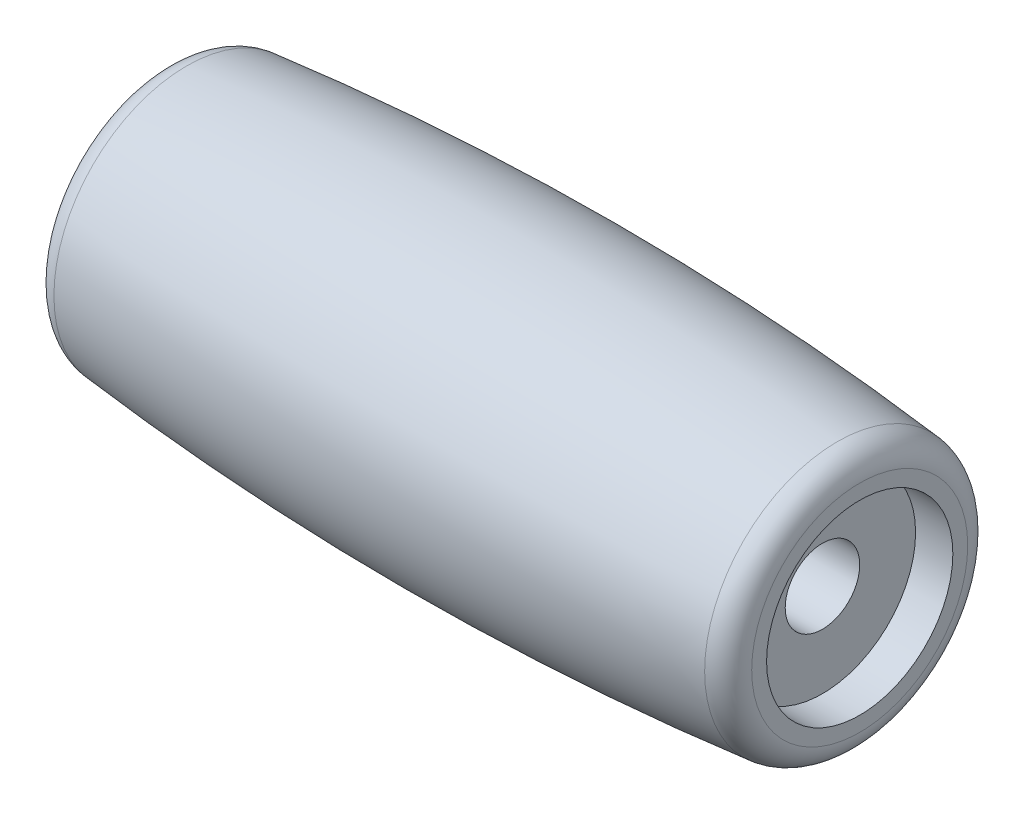
ISO-10303-21;
HEADER;
FILE_DESCRIPTION(('STEP AP214'),'2;1');
FILE_NAME('part.step','',(''),(''),'','','');
FILE_SCHEMA(('AUTOMOTIVE_DESIGN { 1 0 10303 214 1 1 1 1 }'));
ENDSEC;
DATA;
#1=APPLICATION_CONTEXT('core data for automotive mechanical design processes');
#2=APPLICATION_PROTOCOL_DEFINITION('international standard','automotive_design',2000,#1);
#3=PRODUCT_CONTEXT('',#1,'mechanical');
#4=PRODUCT('Part','Part','',(#3));
#5=PRODUCT_RELATED_PRODUCT_CATEGORY('part','',(#4));
#6=PRODUCT_DEFINITION_FORMATION('','',#4);
#7=PRODUCT_DEFINITION_CONTEXT('part definition',#1,'design');
#8=PRODUCT_DEFINITION('design','',#6,#7);
#9=PRODUCT_DEFINITION_SHAPE('','',#8);
#10=(LENGTH_UNIT() NAMED_UNIT(*) SI_UNIT(.MILLI.,.METRE.));
#11=(NAMED_UNIT(*) PLANE_ANGLE_UNIT() SI_UNIT($,.RADIAN.));
#12=(NAMED_UNIT(*) SI_UNIT($,.STERADIAN.) SOLID_ANGLE_UNIT());
#13=UNCERTAINTY_MEASURE_WITH_UNIT(LENGTH_MEASURE(1.E-05),#10,'distance_accuracy_value','');
#14=(GEOMETRIC_REPRESENTATION_CONTEXT(3) GLOBAL_UNCERTAINTY_ASSIGNED_CONTEXT((#13)) GLOBAL_UNIT_ASSIGNED_CONTEXT((#10,
#11,#12)) REPRESENTATION_CONTEXT('',''));
#15=CARTESIAN_POINT('',(0.,0.,0.));
#16=DIRECTION('',(0.,0.,1.));
#17=DIRECTION('',(1.,0.,0.));
#18=AXIS2_PLACEMENT_3D('',#15,#16,#17);
#19=CARTESIAN_POINT('',(-25.,3.,0.));
#20=DIRECTION('',(1.,0.,0.));
#21=DIRECTION('',(0.,0.,-1.));
#22=AXIS2_PLACEMENT_3D('',#19,#20,#21);
#23=PLANE('',#22);
#24=CARTESIAN_POINT('',(-25.,0.,0.));
#25=DIRECTION('',(-1.,0.,0.));
#26=DIRECTION('',(0.,0.,1.));
#27=AXIS2_PLACEMENT_3D('',#24,#25,#26);
#28=CIRCLE('',#27,3.);
#29=CARTESIAN_POINT('',(-25.,0.,3.));
#30=VERTEX_POINT('',#29);
#31=EDGE_CURVE('E68',#30,#30,#28,.T.);
#32=ORIENTED_EDGE('',*,*,#31,.F.);
#33=EDGE_LOOP('',(#32));
#34=FACE_BOUND('',#33,.T.);
#35=CARTESIAN_POINT('',(-25.,0.,0.));
#36=DIRECTION('',(-1.,0.,0.));
#37=DIRECTION('',(0.,0.,1.));
#38=AXIS2_PLACEMENT_3D('',#35,#36,#37);
#39=CIRCLE('',#38,7.49999999999999);
#40=CARTESIAN_POINT('',(-25.,0.,7.49999999999999));
#41=VERTEX_POINT('',#40);
#42=EDGE_CURVE('E10',#41,#41,#39,.T.);
#43=ORIENTED_EDGE('',*,*,#42,.T.);
#44=EDGE_LOOP('',(#43));
#45=FACE_BOUND('',#44,.T.);
#46=ADVANCED_FACE('F34',(#34,#45),#23,.F.);
#47=CARTESIAN_POINT('',(0.,0.,0.));
#48=DIRECTION('',(-1.,0.,0.));
#49=DIRECTION('',(0.,0.,1.));
#50=AXIS2_PLACEMENT_3D('',#47,#48,#49);
#51=CYLINDRICAL_SURFACE('',#50,7.49999999999999);
#52=ORIENTED_EDGE('',*,*,#42,.F.);
#53=EDGE_LOOP('',(#52));
#54=FACE_BOUND('',#53,.T.);
#55=CARTESIAN_POINT('',(-28.,0.,0.));
#56=DIRECTION('',(-1.,0.,0.));
#57=DIRECTION('',(0.,0.,1.));
#58=AXIS2_PLACEMENT_3D('',#55,#56,#57);
#59=CIRCLE('',#58,7.49999999999999);
#60=CARTESIAN_POINT('',(-28.,0.,7.49999999999999));
#61=VERTEX_POINT('',#60);
#62=EDGE_CURVE('E40',#61,#61,#59,.T.);
#63=ORIENTED_EDGE('',*,*,#62,.T.);
#64=EDGE_LOOP('',(#63));
#65=FACE_BOUND('',#64,.T.);
#66=ADVANCED_FACE('F75',(#54,#65),#51,.F.);
#67=CARTESIAN_POINT('',(-28.,7.49999999999999,0.));
#68=DIRECTION('',(1.,0.,0.));
#69=DIRECTION('',(0.,0.,-1.));
#70=AXIS2_PLACEMENT_3D('',#67,#68,#69);
#71=PLANE('',#70);
#72=ORIENTED_EDGE('',*,*,#62,.F.);
#73=EDGE_LOOP('',(#72));
#74=FACE_BOUND('',#73,.T.);
#75=CARTESIAN_POINT('',(-28.,0.,0.));
#76=DIRECTION('',(-1.,0.,0.));
#77=DIRECTION('',(0.,0.,1.));
#78=AXIS2_PLACEMENT_3D('',#75,#76,#77);
#79=CIRCLE('',#78,8.69715333012776);
#80=CARTESIAN_POINT('',(-28.,0.,8.69715333012776));
#81=VERTEX_POINT('',#80);
#82=EDGE_CURVE('E44',#81,#81,#79,.T.);
#83=ORIENTED_EDGE('',*,*,#82,.T.);
#84=EDGE_LOOP('',(#83));
#85=FACE_BOUND('',#84,.T.);
#86=ADVANCED_FACE('F79',(#74,#85),#71,.F.);
#87=CARTESIAN_POINT('',(-26.,0.,0.));
#88=DIRECTION('',(-1.,0.,0.));
#89=DIRECTION('',(0.,0.,1.));
#90=AXIS2_PLACEMENT_3D('',#87,#88,#89);
#91=TOROIDAL_SURFACE('',#90,8.69715333012776,2.00000000000003);
#92=ORIENTED_EDGE('',*,*,#82,.F.);
#93=EDGE_LOOP('',(#92));
#94=FACE_BOUND('',#93,.T.);
#95=CARTESIAN_POINT('',(-26.199935917975,0.,0.));
#96=DIRECTION('',(-1.,0.,0.));
#97=DIRECTION('',(0.,0.,1.));
#98=AXIS2_PLACEMENT_3D('',#95,#96,#97);
#99=CIRCLE('',#98,10.6871346437846);
#100=CARTESIAN_POINT('',(-26.199935917975,0.,10.6871346437846));
#101=VERTEX_POINT('',#100);
#102=EDGE_CURVE('E48',#101,#101,#99,.T.);
#103=ORIENTED_EDGE('',*,*,#102,.T.);
#104=EDGE_LOOP('',(#103));
#105=FACE_BOUND('',#104,.T.);
#106=ADVANCED_FACE('F84',(#94,#105),#91,.T.);
#107=CARTESIAN_POINT('',(0.,0.,0.));
#108=DIRECTION('',(-1.,0.,0.));
#109=DIRECTION('',(0.,0.,1.));
#110=AXIS2_PLACEMENT_3D('',#107,#108,#109);
#111=DEGENERATE_TOROIDAL_SURFACE('',#110,250.083333333333,262.083333333333,.F.);
#112=ORIENTED_EDGE('',*,*,#102,.F.);
#113=EDGE_LOOP('',(#112));
#114=FACE_BOUND('',#113,.T.);
#115=CARTESIAN_POINT('',(26.199935917975,0.,0.));
#116=DIRECTION('',(-1.,0.,0.));
#117=DIRECTION('',(0.,0.,1.));
#118=AXIS2_PLACEMENT_3D('',#115,#116,#117);
#119=CIRCLE('',#118,10.6871346437847);
#120=CARTESIAN_POINT('',(26.199935917975,0.,10.6871346437847));
#121=VERTEX_POINT('',#120);
#122=EDGE_CURVE('E53',#121,#121,#119,.T.);
#123=ORIENTED_EDGE('',*,*,#122,.T.);
#124=EDGE_LOOP('',(#123));
#125=FACE_BOUND('',#124,.T.);
#126=ADVANCED_FACE('F90',(#114,#125),#111,.F.);
#127=CARTESIAN_POINT('',(26.,0.,0.));
#128=DIRECTION('',(-1.,0.,0.));
#129=DIRECTION('',(0.,0.,1.));
#130=AXIS2_PLACEMENT_3D('',#127,#128,#129);
#131=TOROIDAL_SURFACE('',#130,8.69715333012782,2.);
#132=ORIENTED_EDGE('',*,*,#122,.F.);
#133=EDGE_LOOP('',(#132));
#134=FACE_BOUND('',#133,.T.);
#135=CARTESIAN_POINT('',(28.,0.,0.));
#136=DIRECTION('',(-1.,0.,0.));
#137=DIRECTION('',(0.,0.,1.));
#138=AXIS2_PLACEMENT_3D('',#135,#136,#137);
#139=CIRCLE('',#138,8.69715333012782);
#140=CARTESIAN_POINT('',(28.,0.,8.69715333012782));
#141=VERTEX_POINT('',#140);
#142=EDGE_CURVE('E56',#141,#141,#139,.T.);
#143=ORIENTED_EDGE('',*,*,#142,.T.);
#144=EDGE_LOOP('',(#143));
#145=FACE_BOUND('',#144,.T.);
#146=ADVANCED_FACE('F94',(#134,#145),#131,.T.);
#147=CARTESIAN_POINT('',(28.,7.5,0.));
#148=DIRECTION('',(-1.,0.,0.));
#149=DIRECTION('',(0.,0.,1.));
#150=AXIS2_PLACEMENT_3D('',#147,#148,#149);
#151=PLANE('',#150);
#152=ORIENTED_EDGE('',*,*,#142,.F.);
#153=EDGE_LOOP('',(#152));
#154=FACE_BOUND('',#153,.T.);
#155=CARTESIAN_POINT('',(28.,0.,0.));
#156=DIRECTION('',(-1.,0.,0.));
#157=DIRECTION('',(0.,0.,1.));
#158=AXIS2_PLACEMENT_3D('',#155,#156,#157);
#159=CIRCLE('',#158,7.5);
#160=CARTESIAN_POINT('',(28.,0.,7.5));
#161=VERTEX_POINT('',#160);
#162=EDGE_CURVE('E59',#161,#161,#159,.T.);
#163=ORIENTED_EDGE('',*,*,#162,.T.);
#164=EDGE_LOOP('',(#163));
#165=FACE_BOUND('',#164,.T.);
#166=ADVANCED_FACE('F98',(#154,#165),#151,.F.);
#167=CARTESIAN_POINT('',(0.,0.,0.));
#168=DIRECTION('',(-1.,0.,0.));
#169=DIRECTION('',(0.,0.,1.));
#170=AXIS2_PLACEMENT_3D('',#167,#168,#169);
#171=CYLINDRICAL_SURFACE('',#170,7.5);
#172=ORIENTED_EDGE('',*,*,#162,.F.);
#173=EDGE_LOOP('',(#172));
#174=FACE_BOUND('',#173,.T.);
#175=CARTESIAN_POINT('',(25.,0.,0.));
#176=DIRECTION('',(-1.,0.,0.));
#177=DIRECTION('',(0.,0.,1.));
#178=AXIS2_PLACEMENT_3D('',#175,#176,#177);
#179=CIRCLE('',#178,7.5);
#180=CARTESIAN_POINT('',(25.,0.,7.5));
#181=VERTEX_POINT('',#180);
#182=EDGE_CURVE('E62',#181,#181,#179,.T.);
#183=ORIENTED_EDGE('',*,*,#182,.T.);
#184=EDGE_LOOP('',(#183));
#185=FACE_BOUND('',#184,.T.);
#186=ADVANCED_FACE('F102',(#174,#185),#171,.F.);
#187=CARTESIAN_POINT('',(25.,3.,0.));
#188=DIRECTION('',(-1.,0.,0.));
#189=DIRECTION('',(0.,0.,1.));
#190=AXIS2_PLACEMENT_3D('',#187,#188,#189);
#191=PLANE('',#190);
#192=ORIENTED_EDGE('',*,*,#182,.F.);
#193=EDGE_LOOP('',(#192));
#194=FACE_BOUND('',#193,.T.);
#195=CARTESIAN_POINT('',(25.,0.,0.));
#196=DIRECTION('',(-1.,0.,0.));
#197=DIRECTION('',(0.,0.,1.));
#198=AXIS2_PLACEMENT_3D('',#195,#196,#197);
#199=CIRCLE('',#198,3.);
#200=CARTESIAN_POINT('',(25.,0.,3.));
#201=VERTEX_POINT('',#200);
#202=EDGE_CURVE('E65',#201,#201,#199,.T.);
#203=ORIENTED_EDGE('',*,*,#202,.T.);
#204=EDGE_LOOP('',(#203));
#205=FACE_BOUND('',#204,.T.);
#206=ADVANCED_FACE('F106',(#194,#205),#191,.F.);
#207=CARTESIAN_POINT('',(0.,0.,0.));
#208=DIRECTION('',(-1.,0.,0.));
#209=DIRECTION('',(0.,0.,1.));
#210=AXIS2_PLACEMENT_3D('',#207,#208,#209);
#211=CYLINDRICAL_SURFACE('',#210,3.);
#212=ORIENTED_EDGE('',*,*,#202,.F.);
#213=EDGE_LOOP('',(#212));
#214=FACE_BOUND('',#213,.T.);
#215=ORIENTED_EDGE('',*,*,#31,.T.);
#216=EDGE_LOOP('',(#215));
#217=FACE_BOUND('',#216,.T.);
#218=ADVANCED_FACE('F72',(#214,#217),#211,.F.);
#219=CLOSED_SHELL('',(#46,#66,#86,#106,#126,#146,#166,#186,#206,#218));
#220=MANIFOLD_SOLID_BREP('B2',#219);
#221=ADVANCED_BREP_SHAPE_REPRESENTATION('',(#18,#220),#14);
#222=SHAPE_DEFINITION_REPRESENTATION(#9,#221);
ENDSEC;
END-ISO-10303-21;
